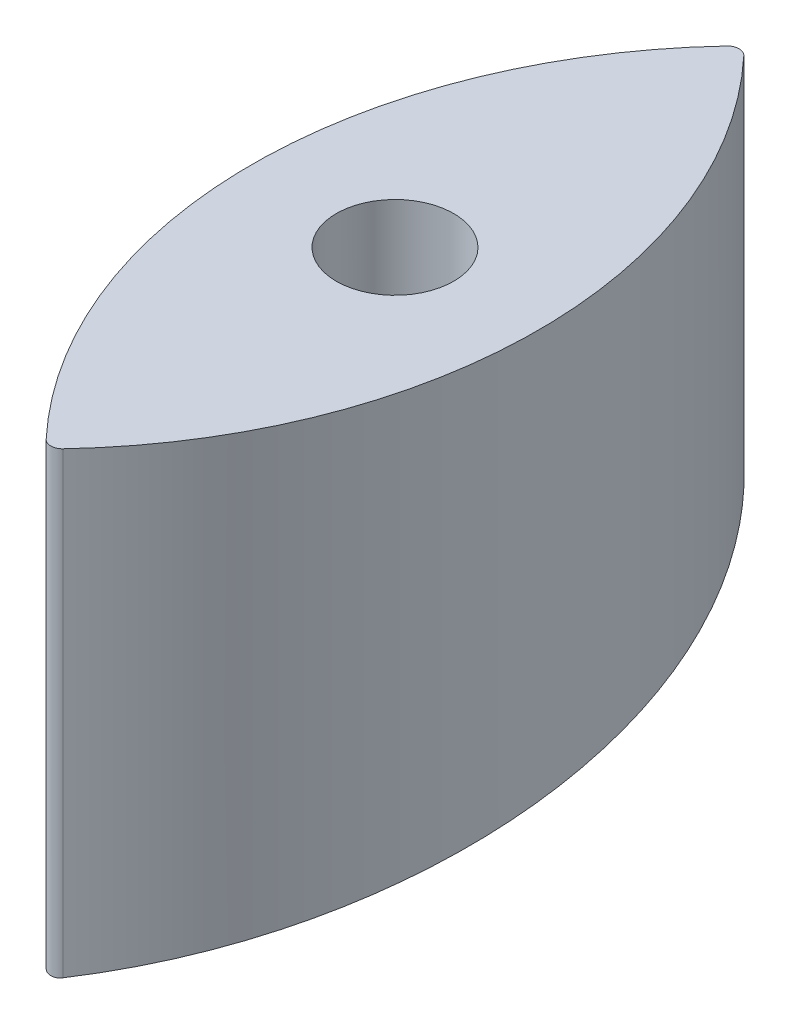
ISO-10303-21;
HEADER;
FILE_DESCRIPTION(('STEP AP214'),'2;1');
FILE_NAME('part.step','',(''),(''),'','','');
FILE_SCHEMA(('AUTOMOTIVE_DESIGN { 1 0 10303 214 1 1 1 1 }'));
ENDSEC;
DATA;
#1=APPLICATION_CONTEXT('core data for automotive mechanical design processes');
#2=APPLICATION_PROTOCOL_DEFINITION('international standard','automotive_design',2000,#1);
#3=PRODUCT_CONTEXT('',#1,'mechanical');
#4=PRODUCT('Part','Part','',(#3));
#5=PRODUCT_RELATED_PRODUCT_CATEGORY('part','',(#4));
#6=PRODUCT_DEFINITION_FORMATION('','',#4);
#7=PRODUCT_DEFINITION_CONTEXT('part definition',#1,'design');
#8=PRODUCT_DEFINITION('design','',#6,#7);
#9=PRODUCT_DEFINITION_SHAPE('','',#8);
#10=(LENGTH_UNIT() NAMED_UNIT(*) SI_UNIT(.MILLI.,.METRE.));
#11=(NAMED_UNIT(*) PLANE_ANGLE_UNIT() SI_UNIT($,.RADIAN.));
#12=(NAMED_UNIT(*) SI_UNIT($,.STERADIAN.) SOLID_ANGLE_UNIT());
#13=UNCERTAINTY_MEASURE_WITH_UNIT(LENGTH_MEASURE(1.E-05),#10,'distance_accuracy_value','');
#14=(GEOMETRIC_REPRESENTATION_CONTEXT(3) GLOBAL_UNCERTAINTY_ASSIGNED_CONTEXT((#13)) GLOBAL_UNIT_ASSIGNED_CONTEXT((#10,
#11,#12)) REPRESENTATION_CONTEXT('',''));
#15=CARTESIAN_POINT('',(0.,0.,0.));
#16=DIRECTION('',(0.,0.,1.));
#17=DIRECTION('',(1.,0.,0.));
#18=AXIS2_PLACEMENT_3D('',#15,#16,#17);
#19=CARTESIAN_POINT('',(-15.875,-5.60113062088327,38.1));
#20=CARTESIAN_POINT('',(-15.875,0.87447524890973,0.218943089501649));
#21=CARTESIAN_POINT('',(-15.875,3.79819630439111,-38.1));
#22=B_SPLINE_CURVE_WITH_KNOTS('',2,(#19,#20,#21),.UNSPECIFIED.,.F.,.F.,(3,3),(0.,1.),.UNSPECIFIED.);
#23=DIRECTION('',(1.,0.,0.));
#24=VECTOR('',#23,1.);
#25=SURFACE_OF_LINEAR_EXTRUSION('',#22,#24);
#26=CARTESIAN_POINT('',(0.,-0.82715851418857,6.5));
#27=CARTESIAN_POINT('',(-0.181486200031751,-0.827158708767825,6.50000134199747));
#28=CARTESIAN_POINT('',(-0.362951016855733,-0.826159974952074,6.49239573497183));
#29=CARTESIAN_POINT('',(-0.724645786499236,-0.822173756678902,6.46202950088044));
#30=CARTESIAN_POINT('',(-0.904875400167979,-0.819185746514917,6.43926486773466));
#31=CARTESIAN_POINT('',(-1.26291208898475,-0.811242905301268,6.3787184929055));
#32=CARTESIAN_POINT('',(-1.4407168661816,-0.80628632676844,6.34092340876601));
#33=CARTESIAN_POINT('',(-1.79254340419213,-0.794447632023745,6.25058277706048));
#34=CARTESIAN_POINT('',(-1.96656375143449,-0.787564809190372,6.19803181644013));
#35=CARTESIAN_POINT('',(-2.30934087421441,-0.771942348168853,6.07863872840814));
#36=CARTESIAN_POINT('',(-2.4781029288323,-0.76320464591218,6.01181150063177));
#37=CARTESIAN_POINT('',(-2.80942650643305,-0.743939748321006,5.8643003410289));
#38=CARTESIAN_POINT('',(-2.97198572168454,-0.733411894767688,5.78361131225869));
#39=CARTESIAN_POINT('',(-3.28960427893543,-0.710665433600101,5.60903941862795));
#40=CARTESIAN_POINT('',(-3.444668112825,-0.698447856003671,5.51516459099428));
#41=CARTESIAN_POINT('',(-3.74638204644291,-0.67241480357477,5.31483068192986));
#42=CARTESIAN_POINT('',(-3.89302900469699,-0.658598737858216,5.20836694666382));
#43=CARTESIAN_POINT('',(-4.17735257527654,-0.629433847505948,4.98324438739918));
#44=CARTESIAN_POINT('',(-4.31499470969821,-0.614079643407104,4.86454271721837));
#45=CARTESIAN_POINT('',(-4.57982599377709,-0.582000719419516,4.61607776130011));
#46=CARTESIAN_POINT('',(-4.70701127373819,-0.565275496699101,4.4863104164322));
#47=CARTESIAN_POINT('',(-4.94996734176846,-0.530599746338052,4.21672147036401));
#48=CARTESIAN_POINT('',(-5.06574153932795,-0.512649587422571,4.07690289407194));
#49=CARTESIAN_POINT('',(-5.28517494404108,-0.475655104037182,3.7881163658636));
#50=CARTESIAN_POINT('',(-5.38882963808313,-0.456610375879745,3.63914503690924));
#51=CARTESIAN_POINT('',(-5.58401332860762,-0.417433360418952,3.33198967022606));
#52=CARTESIAN_POINT('',(-5.67544455812834,-0.397293929576999,3.173744411041));
#53=CARTESIAN_POINT('',(-5.84465858117774,-0.35621014872856,2.85014334231106));
#54=CARTESIAN_POINT('',(-5.92243631259445,-0.335265503677863,2.68478492369268));
#55=CARTESIAN_POINT('',(-6.06375185123827,-0.292745180003163,2.34823537292823));
#56=CARTESIAN_POINT('',(-6.12729442360551,-0.271169715284786,2.1770462147623));
#57=CARTESIAN_POINT('',(-6.239765679904,-0.227535197730653,1.8299257598425));
#58=CARTESIAN_POINT('',(-6.28868893921935,-0.205475968640995,1.65399272916972));
#59=CARTESIAN_POINT('',(-6.37182550188403,-0.160898367685246,1.29751116557778));
#60=CARTESIAN_POINT('',(-6.40594173564514,-0.138377950305278,1.11694015823259));
#61=CARTESIAN_POINT('',(-6.45878624236727,-0.0931819266290625,0.753560869534074));
#62=CARTESIAN_POINT('',(-6.47750880658494,-0.0705062659013574,0.570751783672805));
#63=CARTESIAN_POINT('',(-6.51029797146059,-0.00250886983318592,0.0210325338563689));
#64=CARTESIAN_POINT('',(-6.50107437554704,0.0428308612068717,-0.347550008402007));
#65=CARTESIAN_POINT('',(-6.42043762651969,0.132287292724277,-1.07881936343265));
#66=CARTESIAN_POINT('',(-6.34885804254929,0.176400393863491,-1.44148774998903));
#67=CARTESIAN_POINT('',(-6.14524322143225,0.262097339924481,-2.14981195989754));
#68=CARTESIAN_POINT('',(-6.01320826989401,0.303681196794078,-2.49546786361296));
#69=CARTESIAN_POINT('',(-5.69265377494423,0.383107416235893,-3.15898121360762));
#70=CARTESIAN_POINT('',(-5.50426467178938,0.42095815352243,-3.47690068850452));
#71=CARTESIAN_POINT('',(-5.07611080309801,0.492041789608486,-4.0766186774377));
#72=CARTESIAN_POINT('',(-4.83634751889951,0.525274821510723,-4.35841823259185));
#73=CARTESIAN_POINT('',(-4.31372741511984,0.586093813248225,-4.87608951162656));
#74=CARTESIAN_POINT('',(-4.03113100353031,0.613711683224819,-5.11222036743044));
#75=CARTESIAN_POINT('',(-3.42980729581223,0.66285468713642,-5.53364266449563));
#76=CARTESIAN_POINT('',(-3.11108134721288,0.684380048200073,-5.71893600097104));
#77=CARTESIAN_POINT('',(-2.44885547010409,0.720685523551163,-6.03211112742902));
#78=CARTESIAN_POINT('',(-2.10553678056167,0.735510074852443,-6.16037104458021));
#79=CARTESIAN_POINT('',(-1.40203425537564,0.758268495869342,-6.35749400616033));
#80=CARTESIAN_POINT('',(-1.04185094693846,0.766202580837105,-6.42635890603722));
#81=CARTESIAN_POINT('',(-0.3167544392865,0.774968561473234,-6.50245366931118));
#82=CARTESIAN_POINT('',(0.0481265439107744,0.775835399662692,-6.50998677466107));
#83=CARTESIAN_POINT('',(0.773964199357125,0.770538346574531,-6.46399360184439));
#84=CARTESIAN_POINT('',(1.13492092634381,0.764374553491236,-6.41046817646056));
#85=CARTESIAN_POINT('',(1.84214644974336,0.745176253139101,-6.24405947537962));
#86=CARTESIAN_POINT('',(2.18843524831416,0.732151450766575,-6.13126004330128));
#87=CARTESIAN_POINT('',(2.85710456120715,0.699546688940977,-5.84966346161307));
#88=CARTESIAN_POINT('',(3.17948490015951,0.679966681410933,-5.68086590130365));
#89=CARTESIAN_POINT('',(3.79212025688862,0.634661491320666,-5.29167812416568));
#90=CARTESIAN_POINT('',(4.0822903540099,0.608920603962253,-5.07115608484617));
#91=CARTESIAN_POINT('',(4.62150160109796,0.551946951078477,-4.5851374899837));
#92=CARTESIAN_POINT('',(4.87054164894242,0.520714038434888,-4.31963972965569));
#93=CARTESIAN_POINT('',(5.32196281209478,0.453332512629148,-3.74961405698683));
#94=CARTESIAN_POINT('',(5.52407093195608,0.417156991643486,-3.44487306403934));
#95=CARTESIAN_POINT('',(5.87429851616156,0.340952553451008,-2.8063007402178));
#96=CARTESIAN_POINT('',(6.02241606928738,0.300923499895936,-2.47246838005328));
#97=CARTESIAN_POINT('',(6.26151257000132,0.21773678877234,-1.78254049659815));
#98=CARTESIAN_POINT('',(6.35209948800655,0.174559854660631,-1.42631002869664));
#99=CARTESIAN_POINT('',(6.44210197085206,0.108562351099079,-0.884861835507933));
#100=CARTESIAN_POINT('',(6.46445613522447,0.0863453376438423,-0.703093943291095));
#101=CARTESIAN_POINT('',(6.49375940002083,0.0416418459346806,-0.338371459016822));
#102=CARTESIAN_POINT('',(6.50071410126739,0.0191554686416961,-0.155417322688048));
#103=CARTESIAN_POINT('',(6.49916539389922,-0.0260546107163192,0.211402238903795));
#104=CARTESIAN_POINT('',(6.4905770384274,-0.0487789380299332,0.395267161902867));
#105=CARTESIAN_POINT('',(6.45785052167826,-0.0941734650775921,0.761549041898106));
#106=CARTESIAN_POINT('',(6.43371803832062,-0.116843681543401,0.943966502999049));
#107=CARTESIAN_POINT('',(6.3700617096775,-0.16198177140314,1.30619441815671));
#108=CARTESIAN_POINT('',(6.33053193177753,-0.184449563384311,1.48600383959714));
#109=CARTESIAN_POINT('',(6.2363709035414,-0.228999468644326,1.84160087441094));
#110=CARTESIAN_POINT('',(6.18174526477093,-0.251081722002311,2.01738995601986));
#111=CARTESIAN_POINT('',(6.05767156264019,-0.294734073272896,2.36401116622635));
#112=CARTESIAN_POINT('',(5.98820240373893,-0.316303393208724,2.53483584274881));
#113=CARTESIAN_POINT('',(5.83499502024212,-0.35872328346095,2.8699770752298));
#114=CARTESIAN_POINT('',(5.75126212926856,-0.379574118948313,3.03429603566143));
#115=CARTESIAN_POINT('',(5.57005748130363,-0.420408977287441,3.35536141046589));
#116=CARTESIAN_POINT('',(5.47258122433068,-0.440392713411453,3.51210532188274));
#117=CARTESIAN_POINT('',(5.26462665294041,-0.479319224558279,3.8167668290912));
#118=CARTESIAN_POINT('',(5.15415327699996,-0.498262390975624,3.96468774534106));
#119=CARTESIAN_POINT('',(4.92138013964925,-0.534893761570659,4.25015411799329));
#120=CARTESIAN_POINT('',(4.79912584747032,-0.552586367334746,4.3877360847374));
#121=CARTESIAN_POINT('',(4.54335024596059,-0.586641929311601,4.65207256637658));
#122=CARTESIAN_POINT('',(4.40983323411931,-0.603005388047469,4.77883117429743));
#123=CARTESIAN_POINT('',(4.13234779820246,-0.634282874493434,5.02071693890986));
#124=CARTESIAN_POINT('',(3.98837315068084,-0.649196026559167,5.13583707033636));
#125=CARTESIAN_POINT('',(3.69112165908448,-0.677429644665199,5.353460307083));
#126=CARTESIAN_POINT('',(3.53784838560038,-0.690750716287237,5.45596821017294));
#127=CARTESIAN_POINT('',(3.22410156369457,-0.715608278589488,5.64700591427812));
#128=CARTESIAN_POINT('',(3.06368313112578,-0.727156126863769,5.73562475824433));
#129=CARTESIAN_POINT('',(2.73590407172756,-0.748469957926052,5.89901267834087));
#130=CARTESIAN_POINT('',(2.56854609593366,-0.75823661360449,5.97378698475767));
#131=CARTESIAN_POINT('',(2.22818520358541,-0.775899937232642,6.10890182509238));
#132=CARTESIAN_POINT('',(2.05518773788876,-0.783798353326835,6.16925585285722));
#133=CARTESIAN_POINT('',(1.70470370134514,-0.797665457969888,6.27514916961724));
#134=CARTESIAN_POINT('',(1.52721836934625,-0.803634672925937,6.32069249992164));
#135=CARTESIAN_POINT('',(1.12675266447684,-0.814766808223524,6.40559092224922));
#136=CARTESIAN_POINT('',(0.902901964182511,-0.819408756535207,6.44096256850358));
#137=CARTESIAN_POINT('',(0.45268974955348,-0.825604480923484,6.48816621520257));
#138=CARTESIAN_POINT('',(0.226328247039051,-0.827158271532204,6.49999832641857));
#139=CARTESIAN_POINT('',(0.,-0.82715851418857,6.5));
#140=B_SPLINE_CURVE_WITH_KNOTS('',3,(#26,#27,#28,#29,#30,#31,#32,#33,#34,#35,#36,#37,#38,#39,
#40,#41,#42,#43,#44,#45,#46,#47,#48,#49,#50,#51,#52,#53,#54,#55,#56,#57,#58,#59,#60,#61,#62,#63,
#64,#65,#66,#67,#68,#69,#70,#71,#72,#73,#74,#75,#76,#77,#78,#79,#80,#81,#82,#83,#84,#85,#86,#87,
#88,#89,#90,#91,#92,#93,#94,#95,#96,#97,#98,#99,#100,#101,#102,#103,#104,#105,#106,#107,#108,
#109,#110,#111,#112,#113,#114,#115,#116,#117,#118,#119,#120,#121,#122,#123,#124,#125,#126,#127,
#128,#129,#130,#131,#132,#133,#134,#135,#136,#137,#138,#139),.UNSPECIFIED.,.T.,.F.,(4,2,2,2,2,2,
2,2,2,2,2,2,2,2,2,2,2,2,2,2,2,2,2,2,2,2,2,2,2,2,2,2,2,2,2,2,2,2,2,2,2,2,2,2,2,2,2,2,2,2,2,2,2,2,
2,2,4),(0.,0.544259889698064,1.08866366821923,1.63355179385361,2.17864006829576,
2.72316220863351,3.26788499839538,3.81227718902161,4.35687126206907,4.9034412996228,
5.45021270061704,5.99682023466164,6.54363067276924,7.09458188366943,7.6457369334117,
8.19670721047547,8.74788167643386,9.30261678788601,9.85755753021788,10.9662736197899,
12.0779580190894,13.189637166529,14.2987628160745,15.4078564890724,16.5104594145639,
17.6130212296183,18.7081599942355,19.8032645464444,20.8929512796593,21.9826227937942,
23.0707570903838,24.1588993677072,25.249845555726,26.3408209720376,27.4379917636675,
28.5352013904033,29.639809675124,30.192719263918,30.7454277250805,31.3011660092811,
31.8567014098409,32.4124510715968,32.9679944224642,33.5243326237296,34.0804632488709,
34.6367763922254,35.1928788334881,35.7469149346454,36.3007405816061,36.8548985597333,
37.4088450766492,37.9590805365865,38.5091076986645,39.058618136469,39.6079785064865,
40.2867186333585,40.9654555662354),.UNSPECIFIED.);
#141=CARTESIAN_POINT('',(0.,-0.82715851418857,6.5));
#142=VERTEX_POINT('',#141);
#143=EDGE_CURVE('E251',#142,#142,#140,.T.);
#144=ORIENTED_EDGE('',*,*,#143,.F.);
#145=EDGE_LOOP('',(#144));
#146=FACE_BOUND('',#145,.T.);
#147=CARTESIAN_POINT('',(-0.924852298998186,3.76760737924522,-37.7003724633959));
#148=CARTESIAN_POINT('',(-0.900437450189027,3.7695994304033,-37.7263148232916));
#149=CARTESIAN_POINT('',(-0.874939761061219,3.77151064616231,-37.7512205363488));
#150=CARTESIAN_POINT('',(-0.821936586054585,3.77516049036975,-37.7988087392431));
#151=CARTESIAN_POINT('',(-0.794431102894124,3.77689911905183,-37.8214912320901));
#152=CARTESIAN_POINT('',(-0.709121877744284,3.78184078897914,-37.8859925509265));
#153=CARTESIAN_POINT('',(-0.648540848374029,3.78476835278446,-37.9242487813834));
#154=CARTESIAN_POINT('',(-0.521786880605551,3.78980163358487,-37.9900655321672));
#155=CARTESIAN_POINT('',(-0.455609943261614,3.79190675670586,-38.017618323594));
#156=CARTESIAN_POINT('',(-0.319663047737655,3.79523319761857,-38.061173083678));
#157=CARTESIAN_POINT('',(-0.249902307042534,3.79645667196729,-38.0772032370423));
#158=CARTESIAN_POINT('',(-0.149668601350175,3.79754835689316,-38.0915083292914));
#159=CARTESIAN_POINT('',(-0.119831250529809,3.79779111149884,-38.0946896392673));
#160=CARTESIAN_POINT('',(-0.0600006906924263,3.79811514752569,-38.0989363143615));
#161=CARTESIAN_POINT('',(-0.030007458500525,3.798196404206,-38.1000013552758));
#162=CARTESIAN_POINT('',(0.0711389113564417,3.7981960677592,-38.0999967870375));
#163=CARTESIAN_POINT('',(0.142357778191516,3.79773858689865,-38.0940001558219));
#164=CARTESIAN_POINT('',(0.282872380755645,3.7959184728928,-38.0701522667619));
#165=CARTESIAN_POINT('',(0.352164101947479,3.79455407905834,-38.052277949488));
#166=CARTESIAN_POINT('',(0.486734761173793,3.79095712514535,-38.0051891926804));
#167=CARTESIAN_POINT('',(0.552014802918664,3.78872480510397,-37.9759778885532));
#168=CARTESIAN_POINT('',(0.67666542743912,3.78345386528904,-37.9070706765239));
#169=CARTESIAN_POINT('',(0.736044761724018,3.78041646485471,-37.8673906245424));
#170=CARTESIAN_POINT('',(0.815281790635591,3.77557641469609,-37.8042357025799));
#171=CARTESIAN_POINT('',(0.838253296219879,3.77406636167114,-37.7845404109418));
#172=CARTESIAN_POINT('',(0.882690893624326,3.77092588258052,-37.7436006715184));
#173=CARTESIAN_POINT('',(0.904159467599801,3.76929566457587,-37.7223589021498));
#174=CARTESIAN_POINT('',(0.924852298998215,3.76760737924522,-37.7003724633959));
#175=B_SPLINE_CURVE_WITH_KNOTS('',3,(#147,#148,#149,#150,#151,#152,#153,#154,#155,#156,#157,
#158,#159,#160,#161,#162,#163,#164,#165,#166,#167,#168,#169,#170,#171,#172,#173,#174),
.UNSPECIFIED.,.F.,.F.,(4,2,2,2,2,2,2,2,2,2,2,2,2,4),(0.,0.106973782189321,0.213947419548796,
0.427961691553405,0.642130216208773,0.855773079108211,0.94573435656538,1.03570941467942,
1.24901397305625,1.46273385710615,1.67639467592737,1.889733724488,1.98056000115205,
2.07123255143608),.UNSPECIFIED.);
#176=CARTESIAN_POINT('',(-0.924852298998191,3.76760737924522,-37.7003724633959));
#177=VERTEX_POINT('',#176);
#178=CARTESIAN_POINT('',(0.924852298998205,3.76760737924522,-37.7003724633958));
#179=VERTEX_POINT('',#178);
#180=EDGE_CURVE('E198',#177,#179,#175,.T.);
#181=ORIENTED_EDGE('',*,*,#180,.T.);
#182=CARTESIAN_POINT('',(0.924852298998198,-5.53291689121007,37.7003724633958));
#183=CARTESIAN_POINT('',(1.63769429056655,-5.40381932516261,36.9429554320764));
#184=CARTESIAN_POINT('',(2.32880670549451,-5.27239873338309,36.1654982104775));
#185=CARTESIAN_POINT('',(3.66555791725354,-5.00568002124176,34.5731111136083));
#186=CARTESIAN_POINT('',(4.31119846808194,-4.87038205072658,33.7581826857304));
#187=CARTESIAN_POINT('',(5.55504529053657,-4.5966673572027,32.0934040844691));
#188=CARTESIAN_POINT('',(6.15325167859518,-4.45825064185038,31.2435539968125));
#189=CARTESIAN_POINT('',(7.3015047017057,-4.17879330946169,29.5099918577726));
#190=CARTESIAN_POINT('',(7.85145862714127,-4.03774824641619,28.6262191161617));
#191=CARTESIAN_POINT('',(8.9002490956504,-3.75404200724612,26.8291234978214));
#192=CARTESIAN_POINT('',(9.3990867111069,-3.61138086509547,25.9158012415485));
#193=CARTESIAN_POINT('',(10.3441067679624,-3.32517989179847,24.0624936982507));
#194=CARTESIAN_POINT('',(10.7902914267265,-3.18164009792259,23.1225095361033));
#195=CARTESIAN_POINT('',(11.6288511238253,-2.89431884420866,21.2183197679717));
#196=CARTESIAN_POINT('',(12.0211999774096,-2.75053730096052,20.254102643374));
#197=CARTESIAN_POINT('',(12.750620228193,-2.46348185705496,18.3048495038593));
#198=CARTESIAN_POINT('',(13.087688757843,-2.32020798310875,17.3198124119408));
#199=CARTESIAN_POINT('',(13.7054959416423,-2.03481017923952,15.3318963678363));
#200=CARTESIAN_POINT('',(13.9862259563439,-1.89268642888866,14.3290147048371));
#201=CARTESIAN_POINT('',(14.4896467913042,-1.6106414605219,12.3116183787916));
#202=CARTESIAN_POINT('',(14.7125031050371,-1.47071506165218,11.2971457436918));
#203=CARTESIAN_POINT('',(15.1004595001481,-1.19324884500778,9.25707817921292));
#204=CARTESIAN_POINT('',(15.2655690730395,-1.05570863856315,8.23148510623659));
#205=CARTESIAN_POINT('',(15.5374261054904,-0.783604158817422,6.17279753845036));
#206=CARTESIAN_POINT('',(15.6442084520549,-0.649038152893796,5.13970790307592));
#207=CARTESIAN_POINT('',(15.7727466519642,-0.428589502123104,3.42170904341571));
#208=CARTESIAN_POINT('',(15.8110771975595,-0.341744198070018,2.73812370529744));
#209=CARTESIAN_POINT('',(15.8622073877633,-0.169648388433528,1.36975587985162));
#210=CARTESIAN_POINT('',(15.8750044742454,-0.0843980434921479,0.684973279451828));
#211=CARTESIAN_POINT('',(15.8749899244379,0.190056119932076,-1.54249267356389));
#212=CARTESIAN_POINT('',(15.8100623348753,0.375790165982647,-3.08595229250997));
#213=CARTESIAN_POINT('',(15.5504261132132,0.737363040148761,-6.16374567205544));
#214=CARTESIAN_POINT('',(15.3556445991162,0.913196251171739,-7.6980738193137));
#215=CARTESIAN_POINT('',(14.8366852932159,1.25433719223222,-10.7498376656493));
#216=CARTESIAN_POINT('',(14.5121937876125,1.41961826888573,-12.2672231743019));
#217=CARTESIAN_POINT('',(13.7359003524021,1.73841954810713,-15.2700350137056));
#218=CARTESIAN_POINT('',(13.2841209255199,1.89194182337084,-16.7554669434874));
#219=CARTESIAN_POINT('',(12.2561245357561,2.1867938778826,-19.6840917391139));
#220=CARTESIAN_POINT('',(11.6798921558326,2.328122143517,-21.1272793466221));
#221=CARTESIAN_POINT('',(10.4067867666045,2.598336501163,-23.960967459124));
#222=CARTESIAN_POINT('',(9.70989235437535,2.72722037947183,-25.3514585634332));
#223=CARTESIAN_POINT('',(8.20199031436364,2.97221531401177,-28.0663652894274));
#224=CARTESIAN_POINT('',(7.39122712226879,3.08835280498343,-29.3909144247719));
#225=CARTESIAN_POINT('',(5.66044852953484,3.30827229999937,-31.9668588973828));
#226=CARTESIAN_POINT('',(4.7404954793548,3.41206128822299,-33.2182953805475));
#227=CARTESIAN_POINT('',(3.31675284195158,3.55539870807944,-34.9925761137761));
#228=CARTESIAN_POINT('',(2.85306738275121,3.59965510926557,-35.5476283210566));
#229=CARTESIAN_POINT('',(2.14163946376189,3.66409409843665,-36.3658967212577));
#230=CARTESIAN_POINT('',(1.90200861501868,3.68523631317335,-36.6360959945694));
#231=CARTESIAN_POINT('',(1.41740512791547,3.72689259983658,-37.1717968657141));
#232=CARTESIAN_POINT('',(1.17243155938915,3.74740656086526,-37.4372976307255));
#233=CARTESIAN_POINT('',(0.924852298998202,3.76760737924522,-37.7003724633959));
#234=B_SPLINE_CURVE_WITH_KNOTS('',3,(#182,#183,#184,#185,#186,#187,#188,#189,#190,#191,#192,
#193,#194,#195,#196,#197,#198,#199,#200,#201,#202,#203,#204,#205,#206,#207,#208,#209,#210,#211,
#212,#213,#214,#215,#216,#217,#218,#219,#220,#221,#222,#223,#224,#225,#226,#227,#228,#229,#230,
#231,#232,#233),.UNSPECIFIED.,.F.,.F.,(4,2,2,2,2,2,2,2,2,2,2,2,2,2,2,2,2,2,2,2,2,2,2,2,2,4),(0.,
3.14383450393566,6.28754767348226,9.43125312620035,12.5808721738974,15.7304251313471,
18.8798454048409,22.0307921096477,25.1819022114511,28.3334951638191,31.4759741531841,
34.617936387604,37.7580172704884,39.8279943462248,41.8981787967962,46.5600312277228,
51.2245023818535,55.9003238525223,60.5753192214447,65.250894054175,69.9272990874672,
74.5938147676566,79.2576784423801,81.4309953912964,82.5162366814915,83.6016684445265),.UNSPECIFIED.);
#235=CARTESIAN_POINT('',(0.924852298998205,-5.53291689121007,37.7003724633958));
#236=VERTEX_POINT('',#235);
#237=EDGE_CURVE('E250',#236,#179,#234,.T.);
#238=ORIENTED_EDGE('',*,*,#237,.F.);
#239=CARTESIAN_POINT('',(-0.924852298998221,-5.53291689121006,37.7003724633958));
#240=CARTESIAN_POINT('',(-0.900623106339683,-5.53730489014075,37.7261174736003));
#241=CARTESIAN_POINT('',(-0.875315843931216,-5.54152226510064,37.7508540266791));
#242=CARTESIAN_POINT('',(-0.822692830167762,-5.54958922810563,37.7981580280376));
#243=CARTESIAN_POINT('',(-0.795376973525847,-5.55343879684663,37.8207253624675));
#244=CARTESIAN_POINT('',(-0.710607704890479,-5.56439975051216,37.8849673177786));
#245=CARTESIAN_POINT('',(-0.650362380330777,-5.57091798849127,37.9231502495836));
#246=CARTESIAN_POINT('',(-0.524179658572092,-5.58215781844629,37.9889711999401));
#247=CARTESIAN_POINT('',(-0.458236695660481,-5.58687762872874,38.0165987614103));
#248=CARTESIAN_POINT('',(-0.322671881427541,-5.59435827839231,38.060379079445));
#249=CARTESIAN_POINT('',(-0.253059895885079,-5.59712410935061,38.0765610746364));
#250=CARTESIAN_POINT('',(-0.15241223188506,-5.59962514349494,38.0911930104487));
#251=CARTESIAN_POINT('',(-0.122034155829334,-5.60018909718447,38.0944921726978));
#252=CARTESIAN_POINT('',(-0.0611089557962466,-5.60094199468404,38.098896585595));
#253=CARTESIAN_POINT('',(-0.0305618022557407,-5.60113087069213,38.1000014395831));
#254=CARTESIAN_POINT('',(0.0705429210803696,-5.60113004427309,38.0999966771463));
#255=CARTESIAN_POINT('',(0.141163887773049,-5.60012184071745,38.0940992292604));
#256=CARTESIAN_POINT('',(0.280482926097322,-5.59611536977006,38.070659043649));
#257=CARTESIAN_POINT('',(0.349177146127544,-5.59311337646315,38.0530945029155));
#258=CARTESIAN_POINT('',(0.482561961350141,-5.58521489058321,38.0068659256223));
#259=CARTESIAN_POINT('',(0.547254772269092,-5.58031945757023,37.9782080968076));
#260=CARTESIAN_POINT('',(0.670818802527349,-5.56878736537856,37.9106698249693));
#261=CARTESIAN_POINT('',(0.729697647133149,-5.56215302975396,37.8718030232188));
#262=CARTESIAN_POINT('',(0.809796704629376,-5.5514124459543,37.8088462817621));
#263=CARTESIAN_POINT('',(0.833978605068174,-5.54791200944281,37.7883239438177));
#264=CARTESIAN_POINT('',(0.880675865328805,-5.54062510729265,37.7455917576493));
#265=CARTESIAN_POINT('',(0.903194130351758,-5.53683916478149,37.7233849953503));
#266=CARTESIAN_POINT('',(0.924852298998205,-5.53291689121007,37.7003724633959));
#267=B_SPLINE_CURVE_WITH_KNOTS('',3,(#239,#240,#241,#242,#243,#244,#245,#246,#247,#248,#249,
#250,#251,#252,#253,#254,#255,#256,#257,#258,#259,#260,#261,#262,#263,#264,#265,#266),
.UNSPECIFIED.,.F.,.F.,(4,2,2,2,2,2,2,2,2,2,2,2,2,4),(0.,0.106809362767331,0.213624328287532,
0.427383976089421,0.641354847304472,0.854777118852089,0.946396260112867,1.03803196164967,
1.24954599500289,1.46145641377157,1.67324841962641,1.88475885514812,1.98041126209391,
2.07589247698249),.UNSPECIFIED.);
#268=CARTESIAN_POINT('',(-0.924852298998226,-5.53291689121006,37.7003724633958));
#269=VERTEX_POINT('',#268);
#270=EDGE_CURVE('E12',#269,#236,#267,.T.);
#271=ORIENTED_EDGE('',*,*,#270,.F.);
#272=CARTESIAN_POINT('',(-0.924852298998222,-5.53291689121006,37.7003724633958));
#273=CARTESIAN_POINT('',(-1.63769429056659,-5.4038193251626,36.9429554320764));
#274=CARTESIAN_POINT('',(-2.32880670549455,-5.27239873338308,36.1654982104775));
#275=CARTESIAN_POINT('',(-3.66555791725357,-5.00568002124176,34.5731111136082));
#276=CARTESIAN_POINT('',(-4.31119846808195,-4.87038205072657,33.7581826857303));
#277=CARTESIAN_POINT('',(-5.55504529053659,-4.5966673572027,32.093404084469));
#278=CARTESIAN_POINT('',(-6.1532516785952,-4.45825064185038,31.2435539968125));
#279=CARTESIAN_POINT('',(-7.30150470170572,-4.17879330946169,29.5099918577726));
#280=CARTESIAN_POINT('',(-7.85145862714129,-4.03774824641619,28.6262191161616));
#281=CARTESIAN_POINT('',(-8.90024909565042,-3.75404200724612,26.8291234978214));
#282=CARTESIAN_POINT('',(-9.39908671110692,-3.61138086509547,25.9158012415485));
#283=CARTESIAN_POINT('',(-10.3441067679625,-3.32517989179846,24.0624936982506));
#284=CARTESIAN_POINT('',(-10.7902914267265,-3.18164009792259,23.1225095361032));
#285=CARTESIAN_POINT('',(-11.6288511238253,-2.89431884420865,21.2183197679716));
#286=CARTESIAN_POINT('',(-12.0211999774096,-2.75053730096051,20.254102643374));
#287=CARTESIAN_POINT('',(-12.750620228193,-2.46348185705496,18.3048495038593));
#288=CARTESIAN_POINT('',(-13.087688757843,-2.32020798310875,17.3198124119407));
#289=CARTESIAN_POINT('',(-13.7054959416423,-2.03481017923951,15.3318963678363));
#290=CARTESIAN_POINT('',(-13.9862259563439,-1.89268642888866,14.329014704837));
#291=CARTESIAN_POINT('',(-14.4896467913042,-1.61064146052189,12.3116183787916));
#292=CARTESIAN_POINT('',(-14.7125031050371,-1.47071506165217,11.2971457436917));
#293=CARTESIAN_POINT('',(-15.1004595001481,-1.19324884500778,9.25707817921287));
#294=CARTESIAN_POINT('',(-15.2655690730395,-1.05570863856314,8.23148510623655));
#295=CARTESIAN_POINT('',(-15.5374261054904,-0.783604158817416,6.17279753845032));
#296=CARTESIAN_POINT('',(-15.6442084520549,-0.64903815289379,5.13970790307587));
#297=CARTESIAN_POINT('',(-15.7727466519642,-0.428589502123099,3.42170904341567));
#298=CARTESIAN_POINT('',(-15.8110771975595,-0.341744198070013,2.7381237052974));
#299=CARTESIAN_POINT('',(-15.8622073877633,-0.169648388433525,1.36975587985159));
#300=CARTESIAN_POINT('',(-15.8750044742454,-0.0843980434921446,0.684973279451808));
#301=CARTESIAN_POINT('',(-15.8749899244379,0.19005611993208,-1.54249267356391));
#302=CARTESIAN_POINT('',(-15.8100623348753,0.375790165982649,-3.08595229250999));
#303=CARTESIAN_POINT('',(-15.5504261132132,0.737363040148762,-6.16374567205545));
#304=CARTESIAN_POINT('',(-15.3556445991162,0.91319625117174,-7.69807381931372));
#305=CARTESIAN_POINT('',(-14.8366852932159,1.25433719223222,-10.7498376656493));
#306=CARTESIAN_POINT('',(-14.5121937876125,1.41961826888573,-12.2672231743019));
#307=CARTESIAN_POINT('',(-13.7359003524021,1.73841954810713,-15.2700350137057));
#308=CARTESIAN_POINT('',(-13.2841209255199,1.89194182337084,-16.7554669434874));
#309=CARTESIAN_POINT('',(-12.2561245357561,2.1867938778826,-19.6840917391139));
#310=CARTESIAN_POINT('',(-11.6798921558326,2.32812214351701,-21.1272793466221));
#311=CARTESIAN_POINT('',(-10.4067867666045,2.598336501163,-23.960967459124));
#312=CARTESIAN_POINT('',(-9.70989235437534,2.72722037947183,-25.3514585634332));
#313=CARTESIAN_POINT('',(-8.20199031436363,2.97221531401177,-28.0663652894274));
#314=CARTESIAN_POINT('',(-7.39122712226878,3.08835280498343,-29.390914424772));
#315=CARTESIAN_POINT('',(-5.66044852953483,3.30827229999937,-31.9668588973828));
#316=CARTESIAN_POINT('',(-4.74049547935479,3.41206128822299,-33.2182953805475));
#317=CARTESIAN_POINT('',(-3.31675284195157,3.55539870807944,-34.9925761137762));
#318=CARTESIAN_POINT('',(-2.85306738275119,3.59965510926557,-35.5476283210566));
#319=CARTESIAN_POINT('',(-2.14163946376186,3.66409409843665,-36.3658967212577));
#320=CARTESIAN_POINT('',(-1.90200861501865,3.68523631317335,-36.6360959945694));
#321=CARTESIAN_POINT('',(-1.41740512791545,3.72689259983658,-37.1717968657141));
#322=CARTESIAN_POINT('',(-1.17243155938913,3.74740656086526,-37.4372976307255));
#323=CARTESIAN_POINT('',(-0.924852298998179,3.76760737924522,-37.7003724633959));
#324=B_SPLINE_CURVE_WITH_KNOTS('',3,(#272,#273,#274,#275,#276,#277,#278,#279,#280,#281,#282,
#283,#284,#285,#286,#287,#288,#289,#290,#291,#292,#293,#294,#295,#296,#297,#298,#299,#300,#301,
#302,#303,#304,#305,#306,#307,#308,#309,#310,#311,#312,#313,#314,#315,#316,#317,#318,#319,#320,
#321,#322,#323),.UNSPECIFIED.,.F.,.F.,(4,2,2,2,2,2,2,2,2,2,2,2,2,2,2,2,2,2,2,2,2,2,2,2,2,4),(0.,
3.14383450393566,6.28754767348226,9.43125312620035,12.5808721738974,15.7304251313471,
18.8798454048409,22.0307921096477,25.1819022114511,28.3334951638191,31.4759741531841,
34.617936387604,37.7580172704884,39.8279943462247,41.8981787967961,46.5600312277228,
51.2245023818535,55.9003238525222,60.5753192214447,65.2508940541749,69.9272990874672,
74.5938147676565,79.2576784423801,81.4309953912964,82.5162366814915,83.6016684445265),.UNSPECIFIED.);
#325=EDGE_CURVE('E293',#269,#177,#324,.T.);
#326=ORIENTED_EDGE('',*,*,#325,.T.);
#327=EDGE_LOOP('',(#181,#238,#271,#326));
#328=FACE_BOUND('',#327,.T.);
#329=ADVANCED_FACE('F189',(#146,#328),#25,.T.);
#330=CARTESIAN_POINT('',(-15.875,45.1988693791167,38.1));
#331=DIRECTION('',(0.,1.,0.));
#332=DIRECTION('',(0.,0.,1.));
#333=AXIS2_PLACEMENT_3D('',#330,#331,#332);
#334=PLANE('',#333);
#335=CARTESIAN_POINT('',(-39.1353260869565,45.1988693791167,0.));
#336=DIRECTION('',(0.,1.,0.));
#337=DIRECTION('',(0.,0.,1.));
#338=AXIS2_PLACEMENT_3D('',#335,#336,#337);
#339=CIRCLE('',#338,55.0103260869565);
#340=CARTESIAN_POINT('',(0.924852298998205,45.1988693791167,-37.7003724633958));
#341=VERTEX_POINT('',#340);
#342=CARTESIAN_POINT('',(0.924852298998205,45.1988693791167,37.7003724633958));
#343=VERTEX_POINT('',#342);
#344=EDGE_CURVE('E230',#341,#343,#339,.F.);
#345=ORIENTED_EDGE('',*,*,#344,.F.);
#346=CARTESIAN_POINT('',(0.,45.1988693791167,-36.83));
#347=DIRECTION('',(0.,1.,0.));
#348=DIRECTION('',(0.,0.,1.));
#349=AXIS2_PLACEMENT_3D('',#346,#347,#348);
#350=CIRCLE('',#349,1.27);
#351=CARTESIAN_POINT('',(-0.924852298998191,45.1988693791167,-37.7003724633959));
#352=VERTEX_POINT('',#351);
#353=EDGE_CURVE('E235',#341,#352,#350,.T.);
#354=ORIENTED_EDGE('',*,*,#353,.T.);
#355=CARTESIAN_POINT('',(39.1353260869565,45.1988693791167,0.));
#356=DIRECTION('',(0.,1.,0.));
#357=DIRECTION('',(0.,0.,1.));
#358=AXIS2_PLACEMENT_3D('',#355,#356,#357);
#359=CIRCLE('',#358,55.0103260869565);
#360=CARTESIAN_POINT('',(-0.924852298998226,45.1988693791167,37.7003724633958));
#361=VERTEX_POINT('',#360);
#362=EDGE_CURVE('E245',#352,#361,#359,.T.);
#363=ORIENTED_EDGE('',*,*,#362,.T.);
#364=CARTESIAN_POINT('',(0.,45.1988693791167,36.83));
#365=DIRECTION('',(0.,1.,0.));
#366=DIRECTION('',(0.,0.,1.));
#367=AXIS2_PLACEMENT_3D('',#364,#365,#366);
#368=CIRCLE('',#367,1.27);
#369=EDGE_CURVE('E236',#343,#361,#368,.F.);
#370=ORIENTED_EDGE('',*,*,#369,.F.);
#371=EDGE_LOOP('',(#345,#354,#363,#370));
#372=FACE_BOUND('',#371,.T.);
#373=CARTESIAN_POINT('',(0.,45.1988693791167,0.));
#374=DIRECTION('',(0.,1.,0.));
#375=DIRECTION('',(0.,0.,1.));
#376=AXIS2_PLACEMENT_3D('',#373,#374,#375);
#377=CIRCLE('',#376,6.5);
#378=CARTESIAN_POINT('',(0.,45.1988693791167,6.5));
#379=VERTEX_POINT('',#378);
#380=EDGE_CURVE('E252',#379,#379,#377,.T.);
#381=ORIENTED_EDGE('',*,*,#380,.F.);
#382=EDGE_LOOP('',(#381));
#383=FACE_BOUND('',#382,.T.);
#384=ADVANCED_FACE('F232',(#372,#383),#334,.T.);
#385=CARTESIAN_POINT('',(-39.1353260869565,-5.60113062088327,0.));
#386=DIRECTION('',(0.,1.,0.));
#387=DIRECTION('',(0.,0.,1.));
#388=AXIS2_PLACEMENT_3D('',#385,#386,#387);
#389=CYLINDRICAL_SURFACE('',#388,55.0103260869565);
#390=ORIENTED_EDGE('',*,*,#237,.T.);
#391=DIRECTION('',(0.,1.,0.));
#392=VECTOR('',#391,1.);
#393=CARTESIAN_POINT('',(0.924852298998205,-5.60113062088327,-37.7003724633958));
#394=LINE('',#393,#392);
#395=EDGE_CURVE('E242',#179,#341,#394,.T.);
#396=ORIENTED_EDGE('',*,*,#395,.T.);
#397=ORIENTED_EDGE('',*,*,#344,.T.);
#398=DIRECTION('',(0.,1.,0.));
#399=VECTOR('',#398,1.);
#400=CARTESIAN_POINT('',(0.924852298998205,-5.60113062088327,37.7003724633958));
#401=LINE('',#400,#399);
#402=EDGE_CURVE('E246',#236,#343,#401,.T.);
#403=ORIENTED_EDGE('',*,*,#402,.F.);
#404=EDGE_LOOP('',(#390,#396,#397,#403));
#405=FACE_BOUND('',#404,.T.);
#406=ADVANCED_FACE('F248',(#405),#389,.T.);
#407=CARTESIAN_POINT('',(0.,-5.60113062088327,36.83));
#408=DIRECTION('',(0.,1.,0.));
#409=DIRECTION('',(0.,0.,1.));
#410=AXIS2_PLACEMENT_3D('',#407,#408,#409);
#411=CYLINDRICAL_SURFACE('',#410,1.27);
#412=ORIENTED_EDGE('',*,*,#270,.T.);
#413=ORIENTED_EDGE('',*,*,#402,.T.);
#414=ORIENTED_EDGE('',*,*,#369,.T.);
#415=DIRECTION('',(0.,1.,0.));
#416=VECTOR('',#415,1.);
#417=CARTESIAN_POINT('',(-0.924852298998226,-5.60113062088327,37.7003724633958));
#418=LINE('',#417,#416);
#419=EDGE_CURVE('E239',#269,#361,#418,.T.);
#420=ORIENTED_EDGE('',*,*,#419,.F.);
#421=EDGE_LOOP('',(#412,#413,#414,#420));
#422=FACE_BOUND('',#421,.T.);
#423=ADVANCED_FACE('F269',(#422),#411,.T.);
#424=CARTESIAN_POINT('',(0.,-5.60113062088327,-36.83));
#425=DIRECTION('',(0.,1.,0.));
#426=DIRECTION('',(0.,0.,1.));
#427=AXIS2_PLACEMENT_3D('',#424,#425,#426);
#428=CYLINDRICAL_SURFACE('',#427,1.27);
#429=DIRECTION('',(0.,1.,0.));
#430=VECTOR('',#429,1.);
#431=CARTESIAN_POINT('',(-0.924852298998191,-5.60113062088327,-37.7003724633959));
#432=LINE('',#431,#430);
#433=EDGE_CURVE('E243',#177,#352,#432,.T.);
#434=ORIENTED_EDGE('',*,*,#433,.T.);
#435=ORIENTED_EDGE('',*,*,#353,.F.);
#436=ORIENTED_EDGE('',*,*,#395,.F.);
#437=ORIENTED_EDGE('',*,*,#180,.F.);
#438=EDGE_LOOP('',(#434,#435,#436,#437));
#439=FACE_BOUND('',#438,.T.);
#440=ADVANCED_FACE('F241',(#439),#428,.T.);
#441=CARTESIAN_POINT('',(39.1353260869565,-5.60113062088327,0.));
#442=DIRECTION('',(0.,1.,0.));
#443=DIRECTION('',(0.,0.,1.));
#444=AXIS2_PLACEMENT_3D('',#441,#442,#443);
#445=CYLINDRICAL_SURFACE('',#444,55.0103260869565);
#446=ORIENTED_EDGE('',*,*,#325,.F.);
#447=ORIENTED_EDGE('',*,*,#419,.T.);
#448=ORIENTED_EDGE('',*,*,#362,.F.);
#449=ORIENTED_EDGE('',*,*,#433,.F.);
#450=EDGE_LOOP('',(#446,#447,#448,#449));
#451=FACE_BOUND('',#450,.T.);
#452=ADVANCED_FACE('F267',(#451),#445,.T.);
#453=CARTESIAN_POINT('',(0.,-5.60113062088327,0.));
#454=DIRECTION('',(0.,1.,0.));
#455=DIRECTION('',(0.,0.,1.));
#456=AXIS2_PLACEMENT_3D('',#453,#454,#455);
#457=CYLINDRICAL_SURFACE('',#456,6.5);
#458=ORIENTED_EDGE('',*,*,#143,.T.);
#459=EDGE_LOOP('',(#458));
#460=FACE_BOUND('',#459,.T.);
#461=ORIENTED_EDGE('',*,*,#380,.T.);
#462=EDGE_LOOP('',(#461));
#463=FACE_BOUND('',#462,.T.);
#464=ADVANCED_FACE('F263',(#460,#463),#457,.F.);
#465=CLOSED_SHELL('',(#329,#384,#406,#423,#440,#452,#464));
#466=MANIFOLD_SOLID_BREP('B2',#465);
#467=ADVANCED_BREP_SHAPE_REPRESENTATION('',(#18,#466),#14);
#468=SHAPE_DEFINITION_REPRESENTATION(#9,#467);
ENDSEC;
END-ISO-10303-21;
